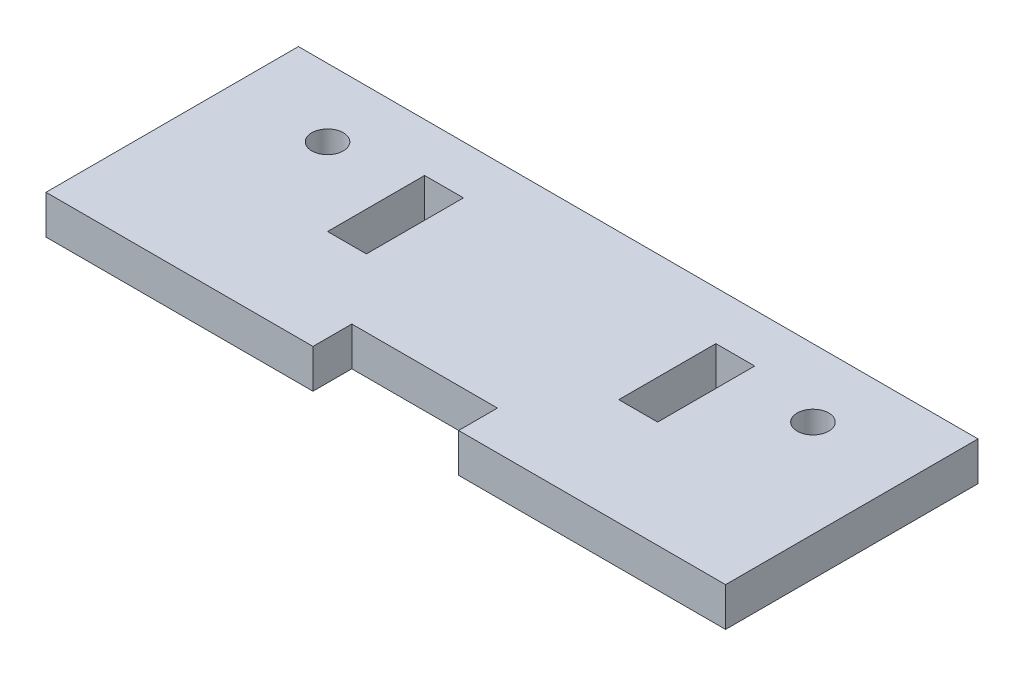
ISO-10303-21;
HEADER;
FILE_DESCRIPTION(('STEP AP214'),'2;1');
FILE_NAME('part.step','',(''),(''),'','','');
FILE_SCHEMA(('AUTOMOTIVE_DESIGN { 1 0 10303 214 1 1 1 1 }'));
ENDSEC;
DATA;
#1=APPLICATION_CONTEXT('core data for automotive mechanical design processes');
#2=APPLICATION_PROTOCOL_DEFINITION('international standard','automotive_design',2000,#1);
#3=PRODUCT_CONTEXT('',#1,'mechanical');
#4=PRODUCT('Part','Part','',(#3));
#5=PRODUCT_RELATED_PRODUCT_CATEGORY('part','',(#4));
#6=PRODUCT_DEFINITION_FORMATION('','',#4);
#7=PRODUCT_DEFINITION_CONTEXT('part definition',#1,'design');
#8=PRODUCT_DEFINITION('design','',#6,#7);
#9=PRODUCT_DEFINITION_SHAPE('','',#8);
#10=(LENGTH_UNIT() NAMED_UNIT(*) SI_UNIT(.MILLI.,.METRE.));
#11=(NAMED_UNIT(*) PLANE_ANGLE_UNIT() SI_UNIT($,.RADIAN.));
#12=(NAMED_UNIT(*) SI_UNIT($,.STERADIAN.) SOLID_ANGLE_UNIT());
#13=UNCERTAINTY_MEASURE_WITH_UNIT(LENGTH_MEASURE(1.E-05),#10,'distance_accuracy_value','');
#14=(GEOMETRIC_REPRESENTATION_CONTEXT(3) GLOBAL_UNCERTAINTY_ASSIGNED_CONTEXT((#13)) GLOBAL_UNIT_ASSIGNED_CONTEXT((#10,
#11,#12)) REPRESENTATION_CONTEXT('',''));
#15=CARTESIAN_POINT('',(0.,0.,0.));
#16=DIRECTION('',(0.,0.,1.));
#17=DIRECTION('',(1.,0.,0.));
#18=AXIS2_PLACEMENT_3D('',#15,#16,#17);
#19=CARTESIAN_POINT('',(0.,4.,0.));
#20=DIRECTION('',(0.,-1.,0.));
#21=DIRECTION('',(0.,0.,-1.));
#22=AXIS2_PLACEMENT_3D('',#19,#20,#21);
#23=PLANE('',#22);
#24=DIRECTION('',(0.,0.,1.));
#25=VECTOR('',#24,1.);
#26=CARTESIAN_POINT('',(18.,4.,-21.));
#27=LINE('',#26,#25);
#28=CARTESIAN_POINT('',(18.,4.,-21.));
#29=VERTEX_POINT('',#28);
#30=CARTESIAN_POINT('',(18.,4.,-11.));
#31=VERTEX_POINT('',#30);
#32=EDGE_CURVE('E210',#29,#31,#27,.T.);
#33=ORIENTED_EDGE('',*,*,#32,.F.);
#34=DIRECTION('',(-1.,0.,0.));
#35=VECTOR('',#34,1.);
#36=CARTESIAN_POINT('',(18.,4.,-21.));
#37=LINE('',#36,#35);
#38=CARTESIAN_POINT('',(22.,4.,-21.));
#39=VERTEX_POINT('',#38);
#40=EDGE_CURVE('E221',#39,#29,#37,.T.);
#41=ORIENTED_EDGE('',*,*,#40,.F.);
#42=DIRECTION('',(0.,0.,-1.));
#43=VECTOR('',#42,1.);
#44=CARTESIAN_POINT('',(22.,4.,-21.));
#45=LINE('',#44,#43);
#46=CARTESIAN_POINT('',(22.,4.,-11.));
#47=VERTEX_POINT('',#46);
#48=EDGE_CURVE('E217',#47,#39,#45,.T.);
#49=ORIENTED_EDGE('',*,*,#48,.F.);
#50=DIRECTION('',(1.,0.,0.));
#51=VECTOR('',#50,1.);
#52=CARTESIAN_POINT('',(18.,4.,-11.));
#53=LINE('',#52,#51);
#54=EDGE_CURVE('E213',#31,#47,#53,.T.);
#55=ORIENTED_EDGE('',*,*,#54,.F.);
#56=EDGE_LOOP('',(#33,#41,#49,#55));
#57=FACE_BOUND('',#56,.T.);
#58=DIRECTION('',(0.,0.,1.));
#59=VECTOR('',#58,1.);
#60=CARTESIAN_POINT('',(0.,4.,0.));
#61=LINE('',#60,#59);
#62=CARTESIAN_POINT('',(0.,4.,-26.));
#63=VERTEX_POINT('',#62);
#64=CARTESIAN_POINT('',(0.,4.,0.));
#65=VERTEX_POINT('',#64);
#66=EDGE_CURVE('E253',#63,#65,#61,.T.);
#67=ORIENTED_EDGE('',*,*,#66,.T.);
#68=DIRECTION('',(1.,0.,0.));
#69=VECTOR('',#68,1.);
#70=CARTESIAN_POINT('',(0.,4.,0.));
#71=LINE('',#70,#69);
#72=CARTESIAN_POINT('',(27.5,4.,0.));
#73=VERTEX_POINT('',#72);
#74=EDGE_CURVE('E257',#65,#73,#71,.T.);
#75=ORIENTED_EDGE('',*,*,#74,.T.);
#76=DIRECTION('',(0.,0.,-1.));
#77=VECTOR('',#76,1.);
#78=CARTESIAN_POINT('',(27.5,4.,0.));
#79=LINE('',#78,#77);
#80=CARTESIAN_POINT('',(27.5,4.,-4.));
#81=VERTEX_POINT('',#80);
#82=EDGE_CURVE('E261',#73,#81,#79,.T.);
#83=ORIENTED_EDGE('',*,*,#82,.T.);
#84=DIRECTION('',(1.,0.,0.));
#85=VECTOR('',#84,1.);
#86=CARTESIAN_POINT('',(27.5,4.,-4.));
#87=LINE('',#86,#85);
#88=CARTESIAN_POINT('',(42.5,4.,-4.));
#89=VERTEX_POINT('',#88);
#90=EDGE_CURVE('E264',#81,#89,#87,.T.);
#91=ORIENTED_EDGE('',*,*,#90,.T.);
#92=DIRECTION('',(0.,0.,1.));
#93=VECTOR('',#92,1.);
#94=CARTESIAN_POINT('',(42.5,4.,0.));
#95=LINE('',#94,#93);
#96=CARTESIAN_POINT('',(42.5,4.,0.));
#97=VERTEX_POINT('',#96);
#98=EDGE_CURVE('E267',#89,#97,#95,.T.);
#99=ORIENTED_EDGE('',*,*,#98,.T.);
#100=DIRECTION('',(1.,0.,0.));
#101=VECTOR('',#100,1.);
#102=CARTESIAN_POINT('',(42.5,4.,0.));
#103=LINE('',#102,#101);
#104=CARTESIAN_POINT('',(70.,4.,0.));
#105=VERTEX_POINT('',#104);
#106=EDGE_CURVE('E270',#97,#105,#103,.T.);
#107=ORIENTED_EDGE('',*,*,#106,.T.);
#108=DIRECTION('',(0.,0.,-1.));
#109=VECTOR('',#108,1.);
#110=CARTESIAN_POINT('',(70.,4.,0.));
#111=LINE('',#110,#109);
#112=CARTESIAN_POINT('',(70.,4.,-26.));
#113=VERTEX_POINT('',#112);
#114=EDGE_CURVE('E273',#105,#113,#111,.T.);
#115=ORIENTED_EDGE('',*,*,#114,.T.);
#116=DIRECTION('',(-1.,0.,0.));
#117=VECTOR('',#116,1.);
#118=CARTESIAN_POINT('',(0.,4.,-26.));
#119=LINE('',#118,#117);
#120=EDGE_CURVE('E276',#113,#63,#119,.T.);
#121=ORIENTED_EDGE('',*,*,#120,.T.);
#122=EDGE_LOOP('',(#67,#75,#83,#91,#99,#107,#115,#121));
#123=FACE_BOUND('',#122,.T.);
#124=DIRECTION('',(0.,0.,-1.));
#125=VECTOR('',#124,1.);
#126=CARTESIAN_POINT('',(52.,4.,-21.));
#127=LINE('',#126,#125);
#128=CARTESIAN_POINT('',(52.,4.,-11.));
#129=VERTEX_POINT('',#128);
#130=CARTESIAN_POINT('',(52.,4.,-21.));
#131=VERTEX_POINT('',#130);
#132=EDGE_CURVE('E159',#129,#131,#127,.T.);
#133=ORIENTED_EDGE('',*,*,#132,.F.);
#134=DIRECTION('',(1.,0.,0.));
#135=VECTOR('',#134,1.);
#136=CARTESIAN_POINT('',(52.,4.,-11.));
#137=LINE('',#136,#135);
#138=CARTESIAN_POINT('',(48.,4.,-11.));
#139=VERTEX_POINT('',#138);
#140=EDGE_CURVE('E186',#139,#129,#137,.T.);
#141=ORIENTED_EDGE('',*,*,#140,.F.);
#142=DIRECTION('',(0.,0.,1.));
#143=VECTOR('',#142,1.);
#144=CARTESIAN_POINT('',(48.,4.,-21.));
#145=LINE('',#144,#143);
#146=CARTESIAN_POINT('',(48.,4.,-21.));
#147=VERTEX_POINT('',#146);
#148=EDGE_CURVE('E182',#147,#139,#145,.T.);
#149=ORIENTED_EDGE('',*,*,#148,.F.);
#150=DIRECTION('',(-1.,0.,0.));
#151=VECTOR('',#150,1.);
#152=CARTESIAN_POINT('',(52.,4.,-21.));
#153=LINE('',#152,#151);
#154=EDGE_CURVE('E168',#131,#147,#153,.T.);
#155=ORIENTED_EDGE('',*,*,#154,.F.);
#156=EDGE_LOOP('',(#133,#141,#149,#155));
#157=FACE_BOUND('',#156,.T.);
#158=CARTESIAN_POINT('',(10.,4.,-19.));
#159=DIRECTION('',(0.,1.,0.));
#160=DIRECTION('',(0.,0.,1.));
#161=AXIS2_PLACEMENT_3D('',#158,#159,#160);
#162=CIRCLE('',#161,1.625);
#163=CARTESIAN_POINT('',(10.,4.,-17.375));
#164=VERTEX_POINT('',#163);
#165=EDGE_CURVE('E194',#164,#164,#162,.T.);
#166=ORIENTED_EDGE('',*,*,#165,.F.);
#167=EDGE_LOOP('',(#166));
#168=FACE_BOUND('',#167,.T.);
#169=CARTESIAN_POINT('',(60.,4.,-19.));
#170=DIRECTION('',(0.,1.,0.));
#171=DIRECTION('',(0.,0.,-1.));
#172=AXIS2_PLACEMENT_3D('',#169,#170,#171);
#173=CIRCLE('',#172,1.625);
#174=CARTESIAN_POINT('',(60.,4.,-20.625));
#175=VERTEX_POINT('',#174);
#176=EDGE_CURVE('E442',#175,#175,#173,.T.);
#177=ORIENTED_EDGE('',*,*,#176,.F.);
#178=EDGE_LOOP('',(#177));
#179=FACE_BOUND('',#178,.T.);
#180=ADVANCED_FACE('F45',(#57,#123,#157,#168,#179),#23,.F.);
#181=CARTESIAN_POINT('',(0.,0.,0.));
#182=DIRECTION('',(0.,-1.,0.));
#183=DIRECTION('',(0.,0.,-1.));
#184=AXIS2_PLACEMENT_3D('',#181,#182,#183);
#185=PLANE('',#184);
#186=CARTESIAN_POINT('',(10.,0.,-19.));
#187=DIRECTION('',(0.,1.,0.));
#188=DIRECTION('',(0.,0.,1.));
#189=AXIS2_PLACEMENT_3D('',#186,#187,#188);
#190=CIRCLE('',#189,1.625);
#191=CARTESIAN_POINT('',(10.,0.,-17.375));
#192=VERTEX_POINT('',#191);
#193=EDGE_CURVE('E450',#192,#192,#190,.T.);
#194=ORIENTED_EDGE('',*,*,#193,.T.);
#195=EDGE_LOOP('',(#194));
#196=FACE_BOUND('',#195,.T.);
#197=DIRECTION('',(0.,0.,1.));
#198=VECTOR('',#197,1.);
#199=CARTESIAN_POINT('',(0.,0.,0.));
#200=LINE('',#199,#198);
#201=CARTESIAN_POINT('',(0.,0.,-26.));
#202=VERTEX_POINT('',#201);
#203=CARTESIAN_POINT('',(0.,0.,0.));
#204=VERTEX_POINT('',#203);
#205=EDGE_CURVE('E252',#202,#204,#200,.T.);
#206=ORIENTED_EDGE('',*,*,#205,.F.);
#207=DIRECTION('',(-1.,0.,0.));
#208=VECTOR('',#207,1.);
#209=CARTESIAN_POINT('',(0.,0.,-26.));
#210=LINE('',#209,#208);
#211=CARTESIAN_POINT('',(70.,0.,-26.));
#212=VERTEX_POINT('',#211);
#213=EDGE_CURVE('E258',#212,#202,#210,.T.);
#214=ORIENTED_EDGE('',*,*,#213,.F.);
#215=DIRECTION('',(0.,0.,-1.));
#216=VECTOR('',#215,1.);
#217=CARTESIAN_POINT('',(70.,0.,0.));
#218=LINE('',#217,#216);
#219=CARTESIAN_POINT('',(70.,0.,0.));
#220=VERTEX_POINT('',#219);
#221=EDGE_CURVE('E299',#220,#212,#218,.T.);
#222=ORIENTED_EDGE('',*,*,#221,.F.);
#223=DIRECTION('',(1.,0.,0.));
#224=VECTOR('',#223,1.);
#225=CARTESIAN_POINT('',(50.,0.,0.));
#226=LINE('',#225,#224);
#227=CARTESIAN_POINT('',(42.5,0.,0.));
#228=VERTEX_POINT('',#227);
#229=EDGE_CURVE('E296',#228,#220,#226,.T.);
#230=ORIENTED_EDGE('',*,*,#229,.F.);
#231=DIRECTION('',(0.,0.,1.));
#232=VECTOR('',#231,1.);
#233=CARTESIAN_POINT('',(42.5,0.,0.));
#234=LINE('',#233,#232);
#235=CARTESIAN_POINT('',(42.5,0.,-4.));
#236=VERTEX_POINT('',#235);
#237=EDGE_CURVE('E292',#236,#228,#234,.T.);
#238=ORIENTED_EDGE('',*,*,#237,.F.);
#239=DIRECTION('',(1.,0.,0.));
#240=VECTOR('',#239,1.);
#241=CARTESIAN_POINT('',(27.5,0.,-4.));
#242=LINE('',#241,#240);
#243=CARTESIAN_POINT('',(27.5,0.,-4.));
#244=VERTEX_POINT('',#243);
#245=EDGE_CURVE('E289',#244,#236,#242,.T.);
#246=ORIENTED_EDGE('',*,*,#245,.F.);
#247=DIRECTION('',(0.,0.,-1.));
#248=VECTOR('',#247,1.);
#249=CARTESIAN_POINT('',(27.5,0.,0.));
#250=LINE('',#249,#248);
#251=CARTESIAN_POINT('',(27.5,0.,0.));
#252=VERTEX_POINT('',#251);
#253=EDGE_CURVE('E286',#252,#244,#250,.T.);
#254=ORIENTED_EDGE('',*,*,#253,.F.);
#255=DIRECTION('',(1.,0.,0.));
#256=VECTOR('',#255,1.);
#257=CARTESIAN_POINT('',(20.,0.,0.));
#258=LINE('',#257,#256);
#259=EDGE_CURVE('E283',#204,#252,#258,.T.);
#260=ORIENTED_EDGE('',*,*,#259,.F.);
#261=EDGE_LOOP('',(#206,#214,#222,#230,#238,#246,#254,#260));
#262=FACE_BOUND('',#261,.T.);
#263=DIRECTION('',(-1.,0.,0.));
#264=VECTOR('',#263,1.);
#265=CARTESIAN_POINT('',(18.,0.,-21.));
#266=LINE('',#265,#264);
#267=CARTESIAN_POINT('',(22.,0.,-21.));
#268=VERTEX_POINT('',#267);
#269=CARTESIAN_POINT('',(18.,0.,-21.));
#270=VERTEX_POINT('',#269);
#271=EDGE_CURVE('E214',#268,#270,#266,.T.);
#272=ORIENTED_EDGE('',*,*,#271,.T.);
#273=DIRECTION('',(0.,0.,1.));
#274=VECTOR('',#273,1.);
#275=CARTESIAN_POINT('',(18.,0.,-21.));
#276=LINE('',#275,#274);
#277=CARTESIAN_POINT('',(18.,0.,-11.));
#278=VERTEX_POINT('',#277);
#279=EDGE_CURVE('E177',#270,#278,#276,.T.);
#280=ORIENTED_EDGE('',*,*,#279,.T.);
#281=DIRECTION('',(1.,0.,0.));
#282=VECTOR('',#281,1.);
#283=CARTESIAN_POINT('',(18.,0.,-11.));
#284=LINE('',#283,#282);
#285=CARTESIAN_POINT('',(22.,0.,-11.));
#286=VERTEX_POINT('',#285);
#287=EDGE_CURVE('E228',#278,#286,#284,.T.);
#288=ORIENTED_EDGE('',*,*,#287,.T.);
#289=DIRECTION('',(0.,0.,-1.));
#290=VECTOR('',#289,1.);
#291=CARTESIAN_POINT('',(22.,0.,-21.));
#292=LINE('',#291,#290);
#293=EDGE_CURVE('E232',#286,#268,#292,.T.);
#294=ORIENTED_EDGE('',*,*,#293,.T.);
#295=EDGE_LOOP('',(#272,#280,#288,#294));
#296=FACE_BOUND('',#295,.T.);
#297=DIRECTION('',(1.,0.,0.));
#298=VECTOR('',#297,1.);
#299=CARTESIAN_POINT('',(52.,0.,-11.));
#300=LINE('',#299,#298);
#301=CARTESIAN_POINT('',(48.,0.,-11.));
#302=VERTEX_POINT('',#301);
#303=CARTESIAN_POINT('',(52.,0.,-11.));
#304=VERTEX_POINT('',#303);
#305=EDGE_CURVE('E169',#302,#304,#300,.T.);
#306=ORIENTED_EDGE('',*,*,#305,.T.);
#307=DIRECTION('',(0.,0.,-1.));
#308=VECTOR('',#307,1.);
#309=CARTESIAN_POINT('',(52.,0.,-21.));
#310=LINE('',#309,#308);
#311=CARTESIAN_POINT('',(52.,0.,-21.));
#312=VERTEX_POINT('',#311);
#313=EDGE_CURVE('E69',#304,#312,#310,.T.);
#314=ORIENTED_EDGE('',*,*,#313,.T.);
#315=DIRECTION('',(-1.,0.,0.));
#316=VECTOR('',#315,1.);
#317=CARTESIAN_POINT('',(52.,0.,-21.));
#318=LINE('',#317,#316);
#319=CARTESIAN_POINT('',(48.,0.,-21.));
#320=VERTEX_POINT('',#319);
#321=EDGE_CURVE('E175',#312,#320,#318,.T.);
#322=ORIENTED_EDGE('',*,*,#321,.T.);
#323=DIRECTION('',(0.,0.,1.));
#324=VECTOR('',#323,1.);
#325=CARTESIAN_POINT('',(48.,0.,-21.));
#326=LINE('',#325,#324);
#327=EDGE_CURVE('E197',#320,#302,#326,.T.);
#328=ORIENTED_EDGE('',*,*,#327,.T.);
#329=EDGE_LOOP('',(#306,#314,#322,#328));
#330=FACE_BOUND('',#329,.T.);
#331=CARTESIAN_POINT('',(60.,0.,-19.));
#332=DIRECTION('',(0.,1.,0.));
#333=DIRECTION('',(0.,0.,-1.));
#334=AXIS2_PLACEMENT_3D('',#331,#332,#333);
#335=CIRCLE('',#334,1.625);
#336=CARTESIAN_POINT('',(60.,0.,-20.625));
#337=VERTEX_POINT('',#336);
#338=EDGE_CURVE('E445',#337,#337,#335,.T.);
#339=ORIENTED_EDGE('',*,*,#338,.T.);
#340=EDGE_LOOP('',(#339));
#341=FACE_BOUND('',#340,.T.);
#342=ADVANCED_FACE('F338',(#196,#262,#296,#330,#341),#185,.T.);
#343=CARTESIAN_POINT('',(0.,4.,0.));
#344=DIRECTION('',(1.,0.,0.));
#345=DIRECTION('',(0.,0.,-1.));
#346=AXIS2_PLACEMENT_3D('',#343,#344,#345);
#347=PLANE('',#346);
#348=ORIENTED_EDGE('',*,*,#205,.T.);
#349=DIRECTION('',(0.,-1.,0.));
#350=VECTOR('',#349,1.);
#351=CARTESIAN_POINT('',(0.,4.,0.));
#352=LINE('',#351,#350);
#353=EDGE_CURVE('E11',#65,#204,#352,.T.);
#354=ORIENTED_EDGE('',*,*,#353,.F.);
#355=ORIENTED_EDGE('',*,*,#66,.F.);
#356=DIRECTION('',(0.,-1.,0.));
#357=VECTOR('',#356,1.);
#358=CARTESIAN_POINT('',(0.,4.,-26.));
#359=LINE('',#358,#357);
#360=EDGE_CURVE('E279',#63,#202,#359,.T.);
#361=ORIENTED_EDGE('',*,*,#360,.T.);
#362=EDGE_LOOP('',(#348,#354,#355,#361));
#363=FACE_BOUND('',#362,.T.);
#364=ADVANCED_FACE('F47',(#363),#347,.F.);
#365=CARTESIAN_POINT('',(20.,4.,0.));
#366=DIRECTION('',(0.,0.,-1.));
#367=DIRECTION('',(-1.,0.,0.));
#368=AXIS2_PLACEMENT_3D('',#365,#366,#367);
#369=PLANE('',#368);
#370=ORIENTED_EDGE('',*,*,#259,.T.);
#371=DIRECTION('',(0.,-1.,0.));
#372=VECTOR('',#371,1.);
#373=CARTESIAN_POINT('',(27.5,4.,0.));
#374=LINE('',#373,#372);
#375=EDGE_CURVE('E54',#73,#252,#374,.T.);
#376=ORIENTED_EDGE('',*,*,#375,.F.);
#377=ORIENTED_EDGE('',*,*,#74,.F.);
#378=ORIENTED_EDGE('',*,*,#353,.T.);
#379=EDGE_LOOP('',(#370,#376,#377,#378));
#380=FACE_BOUND('',#379,.T.);
#381=ADVANCED_FACE('F354',(#380),#369,.F.);
#382=CARTESIAN_POINT('',(27.5,4.,0.));
#383=DIRECTION('',(-1.,0.,0.));
#384=DIRECTION('',(0.,0.,1.));
#385=AXIS2_PLACEMENT_3D('',#382,#383,#384);
#386=PLANE('',#385);
#387=ORIENTED_EDGE('',*,*,#253,.T.);
#388=DIRECTION('',(0.,-1.,0.));
#389=VECTOR('',#388,1.);
#390=CARTESIAN_POINT('',(27.5,4.,-4.));
#391=LINE('',#390,#389);
#392=EDGE_CURVE('E323',#81,#244,#391,.T.);
#393=ORIENTED_EDGE('',*,*,#392,.F.);
#394=ORIENTED_EDGE('',*,*,#82,.F.);
#395=ORIENTED_EDGE('',*,*,#375,.T.);
#396=EDGE_LOOP('',(#387,#393,#394,#395));
#397=FACE_BOUND('',#396,.T.);
#398=ADVANCED_FACE('F332',(#397),#386,.F.);
#399=CARTESIAN_POINT('',(27.5,4.,-4.));
#400=DIRECTION('',(0.,0.,-1.));
#401=DIRECTION('',(-1.,0.,0.));
#402=AXIS2_PLACEMENT_3D('',#399,#400,#401);
#403=PLANE('',#402);
#404=ORIENTED_EDGE('',*,*,#245,.T.);
#405=DIRECTION('',(0.,-1.,0.));
#406=VECTOR('',#405,1.);
#407=CARTESIAN_POINT('',(42.5,4.,-4.));
#408=LINE('',#407,#406);
#409=EDGE_CURVE('E319',#89,#236,#408,.T.);
#410=ORIENTED_EDGE('',*,*,#409,.F.);
#411=ORIENTED_EDGE('',*,*,#90,.F.);
#412=ORIENTED_EDGE('',*,*,#392,.T.);
#413=EDGE_LOOP('',(#404,#410,#411,#412));
#414=FACE_BOUND('',#413,.T.);
#415=ADVANCED_FACE('F343',(#414),#403,.F.);
#416=CARTESIAN_POINT('',(42.5,4.,0.));
#417=DIRECTION('',(1.,0.,0.));
#418=DIRECTION('',(0.,0.,-1.));
#419=AXIS2_PLACEMENT_3D('',#416,#417,#418);
#420=PLANE('',#419);
#421=ORIENTED_EDGE('',*,*,#237,.T.);
#422=DIRECTION('',(0.,-1.,0.));
#423=VECTOR('',#422,1.);
#424=CARTESIAN_POINT('',(42.5,4.,0.));
#425=LINE('',#424,#423);
#426=EDGE_CURVE('E315',#97,#228,#425,.T.);
#427=ORIENTED_EDGE('',*,*,#426,.F.);
#428=ORIENTED_EDGE('',*,*,#98,.F.);
#429=ORIENTED_EDGE('',*,*,#409,.T.);
#430=EDGE_LOOP('',(#421,#427,#428,#429));
#431=FACE_BOUND('',#430,.T.);
#432=ADVANCED_FACE('F347',(#431),#420,.F.);
#433=CARTESIAN_POINT('',(50.,4.,0.));
#434=DIRECTION('',(0.,0.,-1.));
#435=DIRECTION('',(-1.,0.,0.));
#436=AXIS2_PLACEMENT_3D('',#433,#434,#435);
#437=PLANE('',#436);
#438=ORIENTED_EDGE('',*,*,#229,.T.);
#439=DIRECTION('',(0.,-1.,0.));
#440=VECTOR('',#439,1.);
#441=CARTESIAN_POINT('',(70.,4.,0.));
#442=LINE('',#441,#440);
#443=EDGE_CURVE('E311',#105,#220,#442,.T.);
#444=ORIENTED_EDGE('',*,*,#443,.F.);
#445=ORIENTED_EDGE('',*,*,#106,.F.);
#446=ORIENTED_EDGE('',*,*,#426,.T.);
#447=EDGE_LOOP('',(#438,#444,#445,#446));
#448=FACE_BOUND('',#447,.T.);
#449=ADVANCED_FACE('F367',(#448),#437,.F.);
#450=CARTESIAN_POINT('',(70.,4.,0.));
#451=DIRECTION('',(-1.,0.,0.));
#452=DIRECTION('',(0.,0.,1.));
#453=AXIS2_PLACEMENT_3D('',#450,#451,#452);
#454=PLANE('',#453);
#455=ORIENTED_EDGE('',*,*,#221,.T.);
#456=DIRECTION('',(0.,-1.,0.));
#457=VECTOR('',#456,1.);
#458=CARTESIAN_POINT('',(70.,4.,-26.));
#459=LINE('',#458,#457);
#460=EDGE_CURVE('E307',#113,#212,#459,.T.);
#461=ORIENTED_EDGE('',*,*,#460,.F.);
#462=ORIENTED_EDGE('',*,*,#114,.F.);
#463=ORIENTED_EDGE('',*,*,#443,.T.);
#464=EDGE_LOOP('',(#455,#461,#462,#463));
#465=FACE_BOUND('',#464,.T.);
#466=ADVANCED_FACE('F365',(#465),#454,.F.);
#467=CARTESIAN_POINT('',(0.,4.,-26.));
#468=DIRECTION('',(0.,0.,1.));
#469=DIRECTION('',(1.,0.,0.));
#470=AXIS2_PLACEMENT_3D('',#467,#468,#469);
#471=PLANE('',#470);
#472=ORIENTED_EDGE('',*,*,#213,.T.);
#473=ORIENTED_EDGE('',*,*,#360,.F.);
#474=ORIENTED_EDGE('',*,*,#120,.F.);
#475=ORIENTED_EDGE('',*,*,#460,.T.);
#476=EDGE_LOOP('',(#472,#473,#474,#475));
#477=FACE_BOUND('',#476,.T.);
#478=ADVANCED_FACE('F360',(#477),#471,.F.);
#479=CARTESIAN_POINT('',(18.,4.,-21.));
#480=DIRECTION('',(1.,0.,0.));
#481=DIRECTION('',(0.,0.,-1.));
#482=AXIS2_PLACEMENT_3D('',#479,#480,#481);
#483=PLANE('',#482);
#484=ORIENTED_EDGE('',*,*,#279,.F.);
#485=DIRECTION('',(0.,-1.,0.));
#486=VECTOR('',#485,1.);
#487=CARTESIAN_POINT('',(18.,4.,-21.));
#488=LINE('',#487,#486);
#489=EDGE_CURVE('E224',#29,#270,#488,.T.);
#490=ORIENTED_EDGE('',*,*,#489,.F.);
#491=ORIENTED_EDGE('',*,*,#32,.T.);
#492=DIRECTION('',(0.,-1.,0.));
#493=VECTOR('',#492,1.);
#494=CARTESIAN_POINT('',(18.,4.,-11.));
#495=LINE('',#494,#493);
#496=EDGE_CURVE('E248',#31,#278,#495,.T.);
#497=ORIENTED_EDGE('',*,*,#496,.T.);
#498=EDGE_LOOP('',(#484,#490,#491,#497));
#499=FACE_BOUND('',#498,.T.);
#500=ADVANCED_FACE('F386',(#499),#483,.T.);
#501=CARTESIAN_POINT('',(18.,4.,-11.));
#502=DIRECTION('',(0.,0.,-1.));
#503=DIRECTION('',(-1.,0.,0.));
#504=AXIS2_PLACEMENT_3D('',#501,#502,#503);
#505=PLANE('',#504);
#506=ORIENTED_EDGE('',*,*,#287,.F.);
#507=ORIENTED_EDGE('',*,*,#496,.F.);
#508=ORIENTED_EDGE('',*,*,#54,.T.);
#509=DIRECTION('',(0.,-1.,0.));
#510=VECTOR('',#509,1.);
#511=CARTESIAN_POINT('',(22.,4.,-11.));
#512=LINE('',#511,#510);
#513=EDGE_CURVE('E245',#47,#286,#512,.T.);
#514=ORIENTED_EDGE('',*,*,#513,.T.);
#515=EDGE_LOOP('',(#506,#507,#508,#514));
#516=FACE_BOUND('',#515,.T.);
#517=ADVANCED_FACE('F393',(#516),#505,.T.);
#518=CARTESIAN_POINT('',(22.,4.,-21.));
#519=DIRECTION('',(-1.,0.,0.));
#520=DIRECTION('',(0.,0.,1.));
#521=AXIS2_PLACEMENT_3D('',#518,#519,#520);
#522=PLANE('',#521);
#523=ORIENTED_EDGE('',*,*,#293,.F.);
#524=ORIENTED_EDGE('',*,*,#513,.F.);
#525=ORIENTED_EDGE('',*,*,#48,.T.);
#526=DIRECTION('',(0.,-1.,0.));
#527=VECTOR('',#526,1.);
#528=CARTESIAN_POINT('',(22.,4.,-21.));
#529=LINE('',#528,#527);
#530=EDGE_CURVE('E242',#39,#268,#529,.T.);
#531=ORIENTED_EDGE('',*,*,#530,.T.);
#532=EDGE_LOOP('',(#523,#524,#525,#531));
#533=FACE_BOUND('',#532,.T.);
#534=ADVANCED_FACE('F398',(#533),#522,.T.);
#535=CARTESIAN_POINT('',(18.,4.,-21.));
#536=DIRECTION('',(0.,0.,1.));
#537=DIRECTION('',(1.,0.,0.));
#538=AXIS2_PLACEMENT_3D('',#535,#536,#537);
#539=PLANE('',#538);
#540=ORIENTED_EDGE('',*,*,#271,.F.);
#541=ORIENTED_EDGE('',*,*,#530,.F.);
#542=ORIENTED_EDGE('',*,*,#40,.T.);
#543=ORIENTED_EDGE('',*,*,#489,.T.);
#544=EDGE_LOOP('',(#540,#541,#542,#543));
#545=FACE_BOUND('',#544,.T.);
#546=ADVANCED_FACE('F404',(#545),#539,.T.);
#547=CARTESIAN_POINT('',(52.,4.,-21.));
#548=DIRECTION('',(-1.,0.,0.));
#549=DIRECTION('',(0.,0.,1.));
#550=AXIS2_PLACEMENT_3D('',#547,#548,#549);
#551=PLANE('',#550);
#552=ORIENTED_EDGE('',*,*,#313,.F.);
#553=DIRECTION('',(0.,-1.,0.));
#554=VECTOR('',#553,1.);
#555=CARTESIAN_POINT('',(52.,4.,-11.));
#556=LINE('',#555,#554);
#557=EDGE_CURVE('E163',#129,#304,#556,.T.);
#558=ORIENTED_EDGE('',*,*,#557,.F.);
#559=ORIENTED_EDGE('',*,*,#132,.T.);
#560=DIRECTION('',(0.,-1.,0.));
#561=VECTOR('',#560,1.);
#562=CARTESIAN_POINT('',(52.,4.,-21.));
#563=LINE('',#562,#561);
#564=EDGE_CURVE('E162',#131,#312,#563,.T.);
#565=ORIENTED_EDGE('',*,*,#564,.T.);
#566=EDGE_LOOP('',(#552,#558,#559,#565));
#567=FACE_BOUND('',#566,.T.);
#568=ADVANCED_FACE('F161',(#567),#551,.T.);
#569=CARTESIAN_POINT('',(52.,4.,-21.));
#570=DIRECTION('',(0.,0.,1.));
#571=DIRECTION('',(1.,0.,0.));
#572=AXIS2_PLACEMENT_3D('',#569,#570,#571);
#573=PLANE('',#572);
#574=ORIENTED_EDGE('',*,*,#321,.F.);
#575=ORIENTED_EDGE('',*,*,#564,.F.);
#576=ORIENTED_EDGE('',*,*,#154,.T.);
#577=DIRECTION('',(0.,-1.,0.));
#578=VECTOR('',#577,1.);
#579=CARTESIAN_POINT('',(48.,4.,-21.));
#580=LINE('',#579,#578);
#581=EDGE_CURVE('E178',#147,#320,#580,.T.);
#582=ORIENTED_EDGE('',*,*,#581,.T.);
#583=EDGE_LOOP('',(#574,#575,#576,#582));
#584=FACE_BOUND('',#583,.T.);
#585=ADVANCED_FACE('F172',(#584),#573,.T.);
#586=CARTESIAN_POINT('',(48.,4.,-21.));
#587=DIRECTION('',(1.,0.,0.));
#588=DIRECTION('',(0.,0.,-1.));
#589=AXIS2_PLACEMENT_3D('',#586,#587,#588);
#590=PLANE('',#589);
#591=ORIENTED_EDGE('',*,*,#327,.F.);
#592=ORIENTED_EDGE('',*,*,#581,.F.);
#593=ORIENTED_EDGE('',*,*,#148,.T.);
#594=DIRECTION('',(0.,-1.,0.));
#595=VECTOR('',#594,1.);
#596=CARTESIAN_POINT('',(48.,4.,-11.));
#597=LINE('',#596,#595);
#598=EDGE_CURVE('E61',#139,#302,#597,.T.);
#599=ORIENTED_EDGE('',*,*,#598,.T.);
#600=EDGE_LOOP('',(#591,#592,#593,#599));
#601=FACE_BOUND('',#600,.T.);
#602=ADVANCED_FACE('F423',(#601),#590,.T.);
#603=CARTESIAN_POINT('',(52.,4.,-11.));
#604=DIRECTION('',(0.,0.,-1.));
#605=DIRECTION('',(-1.,0.,0.));
#606=AXIS2_PLACEMENT_3D('',#603,#604,#605);
#607=PLANE('',#606);
#608=ORIENTED_EDGE('',*,*,#305,.F.);
#609=ORIENTED_EDGE('',*,*,#598,.F.);
#610=ORIENTED_EDGE('',*,*,#140,.T.);
#611=ORIENTED_EDGE('',*,*,#557,.T.);
#612=EDGE_LOOP('',(#608,#609,#610,#611));
#613=FACE_BOUND('',#612,.T.);
#614=ADVANCED_FACE('F426',(#613),#607,.T.);
#615=CARTESIAN_POINT('',(10.,4.,-19.));
#616=DIRECTION('',(0.,-1.,0.));
#617=DIRECTION('',(0.,0.,-1.));
#618=AXIS2_PLACEMENT_3D('',#615,#616,#617);
#619=CYLINDRICAL_SURFACE('',#618,1.625);
#620=ORIENTED_EDGE('',*,*,#165,.T.);
#621=EDGE_LOOP('',(#620));
#622=FACE_BOUND('',#621,.T.);
#623=ORIENTED_EDGE('',*,*,#193,.F.);
#624=EDGE_LOOP('',(#623));
#625=FACE_BOUND('',#624,.T.);
#626=ADVANCED_FACE('F430',(#622,#625),#619,.F.);
#627=CARTESIAN_POINT('',(60.,4.,-19.));
#628=DIRECTION('',(0.,-1.,0.));
#629=DIRECTION('',(0.,0.,-1.));
#630=AXIS2_PLACEMENT_3D('',#627,#628,#629);
#631=CYLINDRICAL_SURFACE('',#630,1.625);
#632=ORIENTED_EDGE('',*,*,#176,.T.);
#633=EDGE_LOOP('',(#632));
#634=FACE_BOUND('',#633,.T.);
#635=ORIENTED_EDGE('',*,*,#338,.F.);
#636=EDGE_LOOP('',(#635));
#637=FACE_BOUND('',#636,.T.);
#638=ADVANCED_FACE('F433',(#634,#637),#631,.F.);
#639=CLOSED_SHELL('',(#180,#342,#364,#381,#398,#415,#432,#449,#466,#478,#500,#517,#534,#546,
#568,#585,#602,#614,#626,#638));
#640=MANIFOLD_SOLID_BREP('B2',#639);
#641=ADVANCED_BREP_SHAPE_REPRESENTATION('',(#18,#640),#14);
#642=SHAPE_DEFINITION_REPRESENTATION(#9,#641);
ENDSEC;
END-ISO-10303-21;
